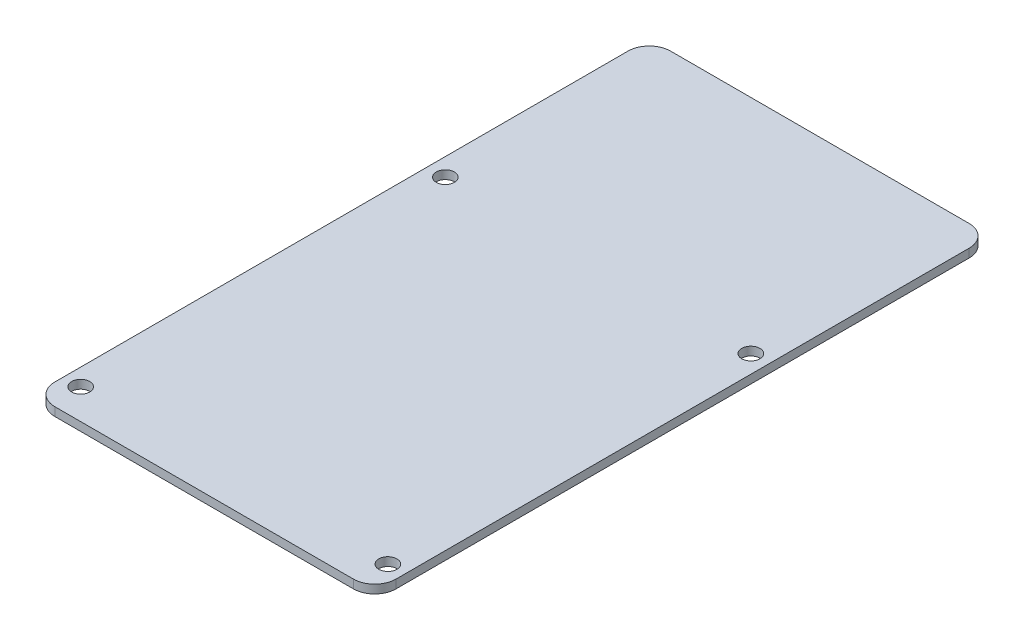
ISO-10303-21;
HEADER;
FILE_DESCRIPTION(('STEP AP214'),'2;1');
FILE_NAME('part.step','',(''),(''),'','','');
FILE_SCHEMA(('AUTOMOTIVE_DESIGN { 1 0 10303 214 1 1 1 1 }'));
ENDSEC;
DATA;
#1=APPLICATION_CONTEXT('core data for automotive mechanical design processes');
#2=APPLICATION_PROTOCOL_DEFINITION('international standard','automotive_design',2000,#1);
#3=PRODUCT_CONTEXT('',#1,'mechanical');
#4=PRODUCT('Part','Part','',(#3));
#5=PRODUCT_RELATED_PRODUCT_CATEGORY('part','',(#4));
#6=PRODUCT_DEFINITION_FORMATION('','',#4);
#7=PRODUCT_DEFINITION_CONTEXT('part definition',#1,'design');
#8=PRODUCT_DEFINITION('design','',#6,#7);
#9=PRODUCT_DEFINITION_SHAPE('','',#8);
#10=(LENGTH_UNIT() NAMED_UNIT(*) SI_UNIT(.MILLI.,.METRE.));
#11=(NAMED_UNIT(*) PLANE_ANGLE_UNIT() SI_UNIT($,.RADIAN.));
#12=(NAMED_UNIT(*) SI_UNIT($,.STERADIAN.) SOLID_ANGLE_UNIT());
#13=UNCERTAINTY_MEASURE_WITH_UNIT(LENGTH_MEASURE(1.E-05),#10,'distance_accuracy_value','');
#14=(GEOMETRIC_REPRESENTATION_CONTEXT(3) GLOBAL_UNCERTAINTY_ASSIGNED_CONTEXT((#13)) GLOBAL_UNIT_ASSIGNED_CONTEXT((#10,
#11,#12)) REPRESENTATION_CONTEXT('',''));
#15=CARTESIAN_POINT('',(0.,0.,0.));
#16=DIRECTION('',(0.,0.,1.));
#17=DIRECTION('',(1.,0.,0.));
#18=AXIS2_PLACEMENT_3D('',#15,#16,#17);
#19=CARTESIAN_POINT('',(35.9582417705588,2.,0.));
#20=DIRECTION('',(-1.,0.,0.));
#21=DIRECTION('',(0.,0.,1.));
#22=AXIS2_PLACEMENT_3D('',#19,#20,#21);
#23=PLANE('',#22);
#24=DIRECTION('',(0.,0.,-1.));
#25=VECTOR('',#24,1.);
#26=CARTESIAN_POINT('',(35.9582417705588,0.,0.));
#27=LINE('',#26,#25);
#28=CARTESIAN_POINT('',(35.9582417705588,0.,66.3053777387011));
#29=VERTEX_POINT('',#28);
#30=CARTESIAN_POINT('',(35.9582417705588,0.,-68.0582835388779));
#31=VERTEX_POINT('',#30);
#32=EDGE_CURVE('E152',#29,#31,#27,.T.);
#33=ORIENTED_EDGE('',*,*,#32,.T.);
#34=DIRECTION('',(0.,-1.,0.));
#35=VECTOR('',#34,1.);
#36=CARTESIAN_POINT('',(35.9582417705588,2.,-68.0582835388779));
#37=LINE('',#36,#35);
#38=CARTESIAN_POINT('',(35.9582417705588,2.,-68.0582835388779));
#39=VERTEX_POINT('',#38);
#40=EDGE_CURVE('E11',#39,#31,#37,.T.);
#41=ORIENTED_EDGE('',*,*,#40,.F.);
#42=DIRECTION('',(0.,0.,-1.));
#43=VECTOR('',#42,1.);
#44=CARTESIAN_POINT('',(35.9582417705588,2.,0.));
#45=LINE('',#44,#43);
#46=CARTESIAN_POINT('',(35.9582417705588,2.,66.3053777387011));
#47=VERTEX_POINT('',#46);
#48=EDGE_CURVE('E198',#47,#39,#45,.T.);
#49=ORIENTED_EDGE('',*,*,#48,.F.);
#50=DIRECTION('',(0.,-1.,0.));
#51=VECTOR('',#50,1.);
#52=CARTESIAN_POINT('',(35.9582417705588,2.,66.3053777387011));
#53=LINE('',#52,#51);
#54=EDGE_CURVE('E136',#47,#29,#53,.T.);
#55=ORIENTED_EDGE('',*,*,#54,.T.);
#56=EDGE_LOOP('',(#33,#41,#49,#55));
#57=FACE_BOUND('',#56,.T.);
#58=ADVANCED_FACE('F43',(#57),#23,.F.);
#59=CARTESIAN_POINT('',(30.9582417705587,2.,-68.0582835388779));
#60=DIRECTION('',(0.,-1.,0.));
#61=DIRECTION('',(0.,0.,-1.));
#62=AXIS2_PLACEMENT_3D('',#59,#60,#61);
#63=CYLINDRICAL_SURFACE('',#62,5.);
#64=CARTESIAN_POINT('',(30.9582417705587,0.,-68.0582835388779));
#65=DIRECTION('',(0.,1.,0.));
#66=DIRECTION('',(0.,0.,1.));
#67=AXIS2_PLACEMENT_3D('',#64,#65,#66);
#68=CIRCLE('',#67,5.);
#69=CARTESIAN_POINT('',(30.9582417705587,0.,-73.0582835388779));
#70=VERTEX_POINT('',#69);
#71=EDGE_CURVE('E155',#31,#70,#68,.T.);
#72=ORIENTED_EDGE('',*,*,#71,.T.);
#73=DIRECTION('',(0.,-1.,0.));
#74=VECTOR('',#73,1.);
#75=CARTESIAN_POINT('',(30.9582417705587,2.,-73.0582835388779));
#76=LINE('',#75,#74);
#77=CARTESIAN_POINT('',(30.9582417705587,2.,-73.0582835388779));
#78=VERTEX_POINT('',#77);
#79=EDGE_CURVE('E52',#78,#70,#76,.T.);
#80=ORIENTED_EDGE('',*,*,#79,.F.);
#81=CARTESIAN_POINT('',(30.9582417705587,2.,-68.0582835388779));
#82=DIRECTION('',(0.,1.,0.));
#83=DIRECTION('',(0.,0.,1.));
#84=AXIS2_PLACEMENT_3D('',#81,#82,#83);
#85=CIRCLE('',#84,5.);
#86=EDGE_CURVE('E103',#39,#78,#85,.T.);
#87=ORIENTED_EDGE('',*,*,#86,.F.);
#88=ORIENTED_EDGE('',*,*,#40,.T.);
#89=EDGE_LOOP('',(#72,#80,#87,#88));
#90=FACE_BOUND('',#89,.T.);
#91=ADVANCED_FACE('F239',(#90),#63,.T.);
#92=CARTESIAN_POINT('',(0.,2.,-73.0582835388779));
#93=DIRECTION('',(0.,0.,1.));
#94=DIRECTION('',(1.,0.,0.));
#95=AXIS2_PLACEMENT_3D('',#92,#93,#94);
#96=PLANE('',#95);
#97=DIRECTION('',(-1.,0.,0.));
#98=VECTOR('',#97,1.);
#99=CARTESIAN_POINT('',(0.,0.,-73.0582835388779));
#100=LINE('',#99,#98);
#101=CARTESIAN_POINT('',(-39.0417582294413,0.,-73.0582835388779));
#102=VERTEX_POINT('',#101);
#103=EDGE_CURVE('E157',#70,#102,#100,.T.);
#104=ORIENTED_EDGE('',*,*,#103,.T.);
#105=DIRECTION('',(0.,-1.,0.));
#106=VECTOR('',#105,1.);
#107=CARTESIAN_POINT('',(-39.0417582294413,2.,-73.0582835388779));
#108=LINE('',#107,#106);
#109=CARTESIAN_POINT('',(-39.0417582294413,2.,-73.0582835388779));
#110=VERTEX_POINT('',#109);
#111=EDGE_CURVE('E173',#110,#102,#108,.T.);
#112=ORIENTED_EDGE('',*,*,#111,.F.);
#113=DIRECTION('',(-1.,0.,0.));
#114=VECTOR('',#113,1.);
#115=CARTESIAN_POINT('',(0.,2.,-73.0582835388779));
#116=LINE('',#115,#114);
#117=EDGE_CURVE('E181',#78,#110,#116,.T.);
#118=ORIENTED_EDGE('',*,*,#117,.F.);
#119=ORIENTED_EDGE('',*,*,#79,.T.);
#120=EDGE_LOOP('',(#104,#112,#118,#119));
#121=FACE_BOUND('',#120,.T.);
#122=ADVANCED_FACE('F179',(#121),#96,.F.);
#123=CARTESIAN_POINT('',(-39.0417582294413,2.,-68.0582835388779));
#124=DIRECTION('',(0.,-1.,0.));
#125=DIRECTION('',(0.,0.,-1.));
#126=AXIS2_PLACEMENT_3D('',#123,#124,#125);
#127=CYLINDRICAL_SURFACE('',#126,5.);
#128=CARTESIAN_POINT('',(-39.0417582294413,0.,-68.0582835388779));
#129=DIRECTION('',(0.,1.,0.));
#130=DIRECTION('',(0.,0.,1.));
#131=AXIS2_PLACEMENT_3D('',#128,#129,#130);
#132=CIRCLE('',#131,5.);
#133=CARTESIAN_POINT('',(-44.0417582294413,0.,-68.0582835388779));
#134=VERTEX_POINT('',#133);
#135=EDGE_CURVE('E159',#102,#134,#132,.T.);
#136=ORIENTED_EDGE('',*,*,#135,.T.);
#137=DIRECTION('',(0.,-1.,0.));
#138=VECTOR('',#137,1.);
#139=CARTESIAN_POINT('',(-44.0417582294413,2.,-68.0582835388779));
#140=LINE('',#139,#138);
#141=CARTESIAN_POINT('',(-44.0417582294413,2.,-68.0582835388779));
#142=VERTEX_POINT('',#141);
#143=EDGE_CURVE('E170',#142,#134,#140,.T.);
#144=ORIENTED_EDGE('',*,*,#143,.F.);
#145=CARTESIAN_POINT('',(-39.0417582294413,2.,-68.0582835388779));
#146=DIRECTION('',(0.,1.,0.));
#147=DIRECTION('',(0.,0.,1.));
#148=AXIS2_PLACEMENT_3D('',#145,#146,#147);
#149=CIRCLE('',#148,5.);
#150=EDGE_CURVE('E193',#110,#142,#149,.T.);
#151=ORIENTED_EDGE('',*,*,#150,.F.);
#152=ORIENTED_EDGE('',*,*,#111,.T.);
#153=EDGE_LOOP('',(#136,#144,#151,#152));
#154=FACE_BOUND('',#153,.T.);
#155=ADVANCED_FACE('F189',(#154),#127,.T.);
#156=CARTESIAN_POINT('',(-44.0417582294413,2.,0.));
#157=DIRECTION('',(1.,0.,0.));
#158=DIRECTION('',(0.,0.,-1.));
#159=AXIS2_PLACEMENT_3D('',#156,#157,#158);
#160=PLANE('',#159);
#161=DIRECTION('',(0.,0.,1.));
#162=VECTOR('',#161,1.);
#163=CARTESIAN_POINT('',(-44.0417582294413,0.,0.));
#164=LINE('',#163,#162);
#165=CARTESIAN_POINT('',(-44.0417582294413,0.,66.3053777387011));
#166=VERTEX_POINT('',#165);
#167=EDGE_CURVE('E161',#134,#166,#164,.T.);
#168=ORIENTED_EDGE('',*,*,#167,.T.);
#169=DIRECTION('',(0.,-1.,0.));
#170=VECTOR('',#169,1.);
#171=CARTESIAN_POINT('',(-44.0417582294413,2.,66.3053777387011));
#172=LINE('',#171,#170);
#173=CARTESIAN_POINT('',(-44.0417582294413,2.,66.3053777387011));
#174=VERTEX_POINT('',#173);
#175=EDGE_CURVE('E131',#174,#166,#172,.T.);
#176=ORIENTED_EDGE('',*,*,#175,.F.);
#177=DIRECTION('',(0.,0.,1.));
#178=VECTOR('',#177,1.);
#179=CARTESIAN_POINT('',(-44.0417582294413,2.,0.));
#180=LINE('',#179,#178);
#181=EDGE_CURVE('E122',#142,#174,#180,.T.);
#182=ORIENTED_EDGE('',*,*,#181,.F.);
#183=ORIENTED_EDGE('',*,*,#143,.T.);
#184=EDGE_LOOP('',(#168,#176,#182,#183));
#185=FACE_BOUND('',#184,.T.);
#186=ADVANCED_FACE('F192',(#185),#160,.F.);
#187=CARTESIAN_POINT('',(-39.0417582294413,2.,66.3053777387011));
#188=DIRECTION('',(0.,-1.,0.));
#189=DIRECTION('',(0.,0.,-1.));
#190=AXIS2_PLACEMENT_3D('',#187,#188,#189);
#191=CYLINDRICAL_SURFACE('',#190,5.);
#192=CARTESIAN_POINT('',(-39.0417582294413,0.,66.3053777387011));
#193=DIRECTION('',(0.,1.,0.));
#194=DIRECTION('',(0.,0.,1.));
#195=AXIS2_PLACEMENT_3D('',#192,#193,#194);
#196=CIRCLE('',#195,5.);
#197=CARTESIAN_POINT('',(-39.0417582294413,0.,71.3053777387011));
#198=VERTEX_POINT('',#197);
#199=EDGE_CURVE('E130',#166,#198,#196,.T.);
#200=ORIENTED_EDGE('',*,*,#199,.T.);
#201=DIRECTION('',(0.,-1.,0.));
#202=VECTOR('',#201,1.);
#203=CARTESIAN_POINT('',(-39.0417582294413,2.,71.3053777387011));
#204=LINE('',#203,#202);
#205=CARTESIAN_POINT('',(-39.0417582294413,2.,71.3053777387011));
#206=VERTEX_POINT('',#205);
#207=EDGE_CURVE('E127',#206,#198,#204,.T.);
#208=ORIENTED_EDGE('',*,*,#207,.F.);
#209=CARTESIAN_POINT('',(-39.0417582294413,2.,66.3053777387011));
#210=DIRECTION('',(0.,1.,0.));
#211=DIRECTION('',(0.,0.,1.));
#212=AXIS2_PLACEMENT_3D('',#209,#210,#211);
#213=CIRCLE('',#212,5.);
#214=EDGE_CURVE('E116',#174,#206,#213,.T.);
#215=ORIENTED_EDGE('',*,*,#214,.F.);
#216=ORIENTED_EDGE('',*,*,#175,.T.);
#217=EDGE_LOOP('',(#200,#208,#215,#216));
#218=FACE_BOUND('',#217,.T.);
#219=ADVANCED_FACE('F128',(#218),#191,.T.);
#220=CARTESIAN_POINT('',(0.,2.,71.3053777387011));
#221=DIRECTION('',(0.,0.,-1.));
#222=DIRECTION('',(-1.,0.,0.));
#223=AXIS2_PLACEMENT_3D('',#220,#221,#222);
#224=PLANE('',#223);
#225=DIRECTION('',(1.,0.,0.));
#226=VECTOR('',#225,1.);
#227=CARTESIAN_POINT('',(0.,0.,71.3053777387011));
#228=LINE('',#227,#226);
#229=CARTESIAN_POINT('',(30.9582417705588,0.,71.3053777387011));
#230=VERTEX_POINT('',#229);
#231=EDGE_CURVE('E89',#198,#230,#228,.T.);
#232=ORIENTED_EDGE('',*,*,#231,.T.);
#233=DIRECTION('',(0.,-1.,0.));
#234=VECTOR('',#233,1.);
#235=CARTESIAN_POINT('',(30.9582417705588,2.,71.3053777387011));
#236=LINE('',#235,#234);
#237=CARTESIAN_POINT('',(30.9582417705588,2.,71.3053777387011));
#238=VERTEX_POINT('',#237);
#239=EDGE_CURVE('E132',#238,#230,#236,.T.);
#240=ORIENTED_EDGE('',*,*,#239,.F.);
#241=DIRECTION('',(1.,0.,0.));
#242=VECTOR('',#241,1.);
#243=CARTESIAN_POINT('',(0.,2.,71.3053777387011));
#244=LINE('',#243,#242);
#245=EDGE_CURVE('E120',#206,#238,#244,.T.);
#246=ORIENTED_EDGE('',*,*,#245,.F.);
#247=ORIENTED_EDGE('',*,*,#207,.T.);
#248=EDGE_LOOP('',(#232,#240,#246,#247));
#249=FACE_BOUND('',#248,.T.);
#250=ADVANCED_FACE('F134',(#249),#224,.F.);
#251=CARTESIAN_POINT('',(31.7679190324166,2.,-21.0582835388779));
#252=DIRECTION('',(0.,-1.,0.));
#253=DIRECTION('',(0.,0.,-1.));
#254=AXIS2_PLACEMENT_3D('',#251,#252,#253);
#255=CYLINDRICAL_SURFACE('',#254,2.125);
#256=CARTESIAN_POINT('',(31.7679190324166,2.,-21.0582835388779));
#257=DIRECTION('',(0.,1.,0.));
#258=DIRECTION('',(0.,0.,1.));
#259=AXIS2_PLACEMENT_3D('',#256,#257,#258);
#260=CIRCLE('',#259,2.125);
#261=CARTESIAN_POINT('',(31.7679190324166,2.,-18.9332835388779));
#262=VERTEX_POINT('',#261);
#263=EDGE_CURVE('E200',#262,#262,#260,.T.);
#264=ORIENTED_EDGE('',*,*,#263,.T.);
#265=EDGE_LOOP('',(#264));
#266=FACE_BOUND('',#265,.T.);
#267=CARTESIAN_POINT('',(31.7679190324166,0.,-21.0582835388779));
#268=DIRECTION('',(0.,1.,0.));
#269=DIRECTION('',(0.,0.,1.));
#270=AXIS2_PLACEMENT_3D('',#267,#268,#269);
#271=CIRCLE('',#270,2.125);
#272=CARTESIAN_POINT('',(31.7679190324166,0.,-18.9332835388779));
#273=VERTEX_POINT('',#272);
#274=EDGE_CURVE('E149',#273,#273,#271,.T.);
#275=ORIENTED_EDGE('',*,*,#274,.F.);
#276=EDGE_LOOP('',(#275));
#277=FACE_BOUND('',#276,.T.);
#278=ADVANCED_FACE('F224',(#266,#277),#255,.F.);
#279=CARTESIAN_POINT('',(-39.8514354912995,2.,-21.0582835388779));
#280=DIRECTION('',(0.,-1.,0.));
#281=DIRECTION('',(0.,0.,-1.));
#282=AXIS2_PLACEMENT_3D('',#279,#280,#281);
#283=CYLINDRICAL_SURFACE('',#282,2.125);
#284=CARTESIAN_POINT('',(-39.8514354912995,2.,-21.0582835388779));
#285=DIRECTION('',(0.,1.,0.));
#286=DIRECTION('',(0.,0.,1.));
#287=AXIS2_PLACEMENT_3D('',#284,#285,#286);
#288=CIRCLE('',#287,2.125);
#289=CARTESIAN_POINT('',(-39.8514354912995,2.,-18.9332835388779));
#290=VERTEX_POINT('',#289);
#291=EDGE_CURVE('E203',#290,#290,#288,.T.);
#292=ORIENTED_EDGE('',*,*,#291,.T.);
#293=EDGE_LOOP('',(#292));
#294=FACE_BOUND('',#293,.T.);
#295=CARTESIAN_POINT('',(-39.8514354912995,0.,-21.0582835388779));
#296=DIRECTION('',(0.,1.,0.));
#297=DIRECTION('',(0.,0.,1.));
#298=AXIS2_PLACEMENT_3D('',#295,#296,#297);
#299=CIRCLE('',#298,2.125);
#300=CARTESIAN_POINT('',(-39.8514354912995,0.,-18.9332835388779));
#301=VERTEX_POINT('',#300);
#302=EDGE_CURVE('E146',#301,#301,#299,.T.);
#303=ORIENTED_EDGE('',*,*,#302,.F.);
#304=EDGE_LOOP('',(#303));
#305=FACE_BOUND('',#304,.T.);
#306=ADVANCED_FACE('F227',(#294,#305),#283,.F.);
#307=CARTESIAN_POINT('',(-40.0417582294413,2.,64.2270579500624));
#308=DIRECTION('',(0.,-1.,0.));
#309=DIRECTION('',(0.,0.,-1.));
#310=AXIS2_PLACEMENT_3D('',#307,#308,#309);
#311=CYLINDRICAL_SURFACE('',#310,2.125);
#312=CARTESIAN_POINT('',(-40.0417582294413,2.,64.2270579500624));
#313=DIRECTION('',(0.,1.,0.));
#314=DIRECTION('',(0.,0.,1.));
#315=AXIS2_PLACEMENT_3D('',#312,#313,#314);
#316=CIRCLE('',#315,2.125);
#317=CARTESIAN_POINT('',(-40.0417582294413,2.,66.3520579500624));
#318=VERTEX_POINT('',#317);
#319=EDGE_CURVE('E206',#318,#318,#316,.T.);
#320=ORIENTED_EDGE('',*,*,#319,.T.);
#321=EDGE_LOOP('',(#320));
#322=FACE_BOUND('',#321,.T.);
#323=CARTESIAN_POINT('',(-40.0417582294413,0.,64.2270579500624));
#324=DIRECTION('',(0.,1.,0.));
#325=DIRECTION('',(0.,0.,1.));
#326=AXIS2_PLACEMENT_3D('',#323,#324,#325);
#327=CIRCLE('',#326,2.125);
#328=CARTESIAN_POINT('',(-40.0417582294413,0.,66.3520579500624));
#329=VERTEX_POINT('',#328);
#330=EDGE_CURVE('E143',#329,#329,#327,.T.);
#331=ORIENTED_EDGE('',*,*,#330,.F.);
#332=EDGE_LOOP('',(#331));
#333=FACE_BOUND('',#332,.T.);
#334=ADVANCED_FACE('F249',(#322,#333),#311,.F.);
#335=CARTESIAN_POINT('',(31.9582417705587,2.,64.2270579500624));
#336=DIRECTION('',(0.,-1.,0.));
#337=DIRECTION('',(0.,0.,-1.));
#338=AXIS2_PLACEMENT_3D('',#335,#336,#337);
#339=CYLINDRICAL_SURFACE('',#338,2.125);
#340=CARTESIAN_POINT('',(31.9582417705587,2.,64.2270579500624));
#341=DIRECTION('',(0.,1.,0.));
#342=DIRECTION('',(0.,0.,1.));
#343=AXIS2_PLACEMENT_3D('',#340,#341,#342);
#344=CIRCLE('',#343,2.125);
#345=CARTESIAN_POINT('',(31.9582417705587,2.,66.3520579500624));
#346=VERTEX_POINT('',#345);
#347=EDGE_CURVE('E166',#346,#346,#344,.T.);
#348=ORIENTED_EDGE('',*,*,#347,.T.);
#349=EDGE_LOOP('',(#348));
#350=FACE_BOUND('',#349,.T.);
#351=CARTESIAN_POINT('',(31.9582417705587,0.,64.2270579500624));
#352=DIRECTION('',(0.,1.,0.));
#353=DIRECTION('',(0.,0.,1.));
#354=AXIS2_PLACEMENT_3D('',#351,#352,#353);
#355=CIRCLE('',#354,2.125);
#356=CARTESIAN_POINT('',(31.9582417705587,0.,66.3520579500624));
#357=VERTEX_POINT('',#356);
#358=EDGE_CURVE('E140',#357,#357,#355,.T.);
#359=ORIENTED_EDGE('',*,*,#358,.F.);
#360=EDGE_LOOP('',(#359));
#361=FACE_BOUND('',#360,.T.);
#362=ADVANCED_FACE('F45',(#350,#361),#339,.F.);
#363=CARTESIAN_POINT('',(30.9582417705588,2.,66.3053777387011));
#364=DIRECTION('',(0.,-1.,0.));
#365=DIRECTION('',(0.,0.,-1.));
#366=AXIS2_PLACEMENT_3D('',#363,#364,#365);
#367=CYLINDRICAL_SURFACE('',#366,5.);
#368=CARTESIAN_POINT('',(30.9582417705588,0.,66.3053777387011));
#369=DIRECTION('',(0.,1.,0.));
#370=DIRECTION('',(0.,0.,1.));
#371=AXIS2_PLACEMENT_3D('',#368,#369,#370);
#372=CIRCLE('',#371,5.);
#373=EDGE_CURVE('E95',#230,#29,#372,.T.);
#374=ORIENTED_EDGE('',*,*,#373,.T.);
#375=ORIENTED_EDGE('',*,*,#54,.F.);
#376=CARTESIAN_POINT('',(30.9582417705588,2.,66.3053777387011));
#377=DIRECTION('',(0.,1.,0.));
#378=DIRECTION('',(0.,0.,1.));
#379=AXIS2_PLACEMENT_3D('',#376,#377,#378);
#380=CIRCLE('',#379,5.);
#381=EDGE_CURVE('E60',#238,#47,#380,.T.);
#382=ORIENTED_EDGE('',*,*,#381,.F.);
#383=ORIENTED_EDGE('',*,*,#239,.T.);
#384=EDGE_LOOP('',(#374,#375,#382,#383));
#385=FACE_BOUND('',#384,.T.);
#386=ADVANCED_FACE('F216',(#385),#367,.T.);
#387=CARTESIAN_POINT('',(0.,2.,0.));
#388=DIRECTION('',(0.,1.,0.));
#389=DIRECTION('',(0.,0.,1.));
#390=AXIS2_PLACEMENT_3D('',#387,#388,#389);
#391=PLANE('',#390);
#392=ORIENTED_EDGE('',*,*,#347,.F.);
#393=EDGE_LOOP('',(#392));
#394=FACE_BOUND('',#393,.T.);
#395=ORIENTED_EDGE('',*,*,#319,.F.);
#396=EDGE_LOOP('',(#395));
#397=FACE_BOUND('',#396,.T.);
#398=ORIENTED_EDGE('',*,*,#291,.F.);
#399=EDGE_LOOP('',(#398));
#400=FACE_BOUND('',#399,.T.);
#401=ORIENTED_EDGE('',*,*,#263,.F.);
#402=EDGE_LOOP('',(#401));
#403=FACE_BOUND('',#402,.T.);
#404=ORIENTED_EDGE('',*,*,#48,.T.);
#405=ORIENTED_EDGE('',*,*,#86,.T.);
#406=ORIENTED_EDGE('',*,*,#117,.T.);
#407=ORIENTED_EDGE('',*,*,#150,.T.);
#408=ORIENTED_EDGE('',*,*,#181,.T.);
#409=ORIENTED_EDGE('',*,*,#214,.T.);
#410=ORIENTED_EDGE('',*,*,#245,.T.);
#411=ORIENTED_EDGE('',*,*,#381,.T.);
#412=EDGE_LOOP('',(#404,#405,#406,#407,#408,#409,#410,#411));
#413=FACE_BOUND('',#412,.T.);
#414=ADVANCED_FACE('F118',(#394,#397,#400,#403,#413),#391,.T.);
#415=CARTESIAN_POINT('',(0.,0.,0.));
#416=DIRECTION('',(0.,1.,0.));
#417=DIRECTION('',(0.,0.,1.));
#418=AXIS2_PLACEMENT_3D('',#415,#416,#417);
#419=PLANE('',#418);
#420=ORIENTED_EDGE('',*,*,#358,.T.);
#421=EDGE_LOOP('',(#420));
#422=FACE_BOUND('',#421,.T.);
#423=ORIENTED_EDGE('',*,*,#330,.T.);
#424=EDGE_LOOP('',(#423));
#425=FACE_BOUND('',#424,.T.);
#426=ORIENTED_EDGE('',*,*,#302,.T.);
#427=EDGE_LOOP('',(#426));
#428=FACE_BOUND('',#427,.T.);
#429=ORIENTED_EDGE('',*,*,#274,.T.);
#430=EDGE_LOOP('',(#429));
#431=FACE_BOUND('',#430,.T.);
#432=ORIENTED_EDGE('',*,*,#32,.F.);
#433=ORIENTED_EDGE('',*,*,#373,.F.);
#434=ORIENTED_EDGE('',*,*,#231,.F.);
#435=ORIENTED_EDGE('',*,*,#199,.F.);
#436=ORIENTED_EDGE('',*,*,#167,.F.);
#437=ORIENTED_EDGE('',*,*,#135,.F.);
#438=ORIENTED_EDGE('',*,*,#103,.F.);
#439=ORIENTED_EDGE('',*,*,#71,.F.);
#440=EDGE_LOOP('',(#432,#433,#434,#435,#436,#437,#438,#439));
#441=FACE_BOUND('',#440,.T.);
#442=ADVANCED_FACE('F185',(#422,#425,#428,#431,#441),#419,.F.);
#443=CLOSED_SHELL('',(#58,#91,#122,#155,#186,#219,#250,#278,#306,#334,#362,#386,#414,#442));
#444=MANIFOLD_SOLID_BREP('B2',#443);
#445=ADVANCED_BREP_SHAPE_REPRESENTATION('',(#18,#444),#14);
#446=SHAPE_DEFINITION_REPRESENTATION(#9,#445);
ENDSEC;
END-ISO-10303-21;
